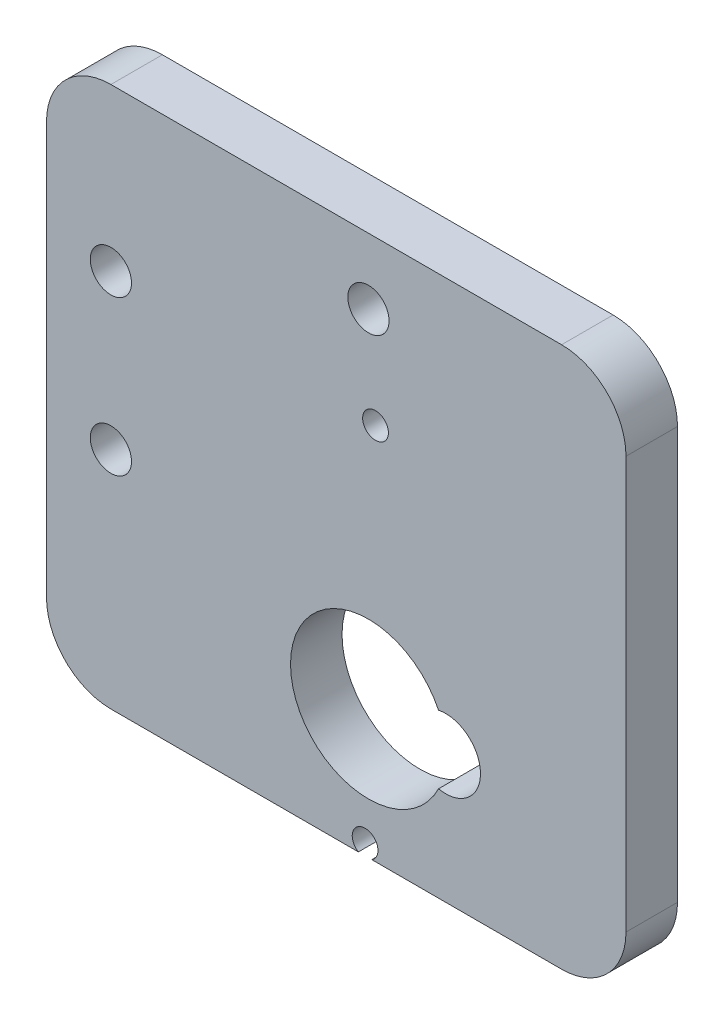
ISO-10303-21;
HEADER;
FILE_DESCRIPTION(('STEP AP214'),'2;1');
FILE_NAME('part.step','',(''),(''),'','','');
FILE_SCHEMA(('AUTOMOTIVE_DESIGN { 1 0 10303 214 1 1 1 1 }'));
ENDSEC;
DATA;
#1=APPLICATION_CONTEXT('core data for automotive mechanical design processes');
#2=APPLICATION_PROTOCOL_DEFINITION('international standard','automotive_design',2000,#1);
#3=PRODUCT_CONTEXT('',#1,'mechanical');
#4=PRODUCT('Part','Part','',(#3));
#5=PRODUCT_RELATED_PRODUCT_CATEGORY('part','',(#4));
#6=PRODUCT_DEFINITION_FORMATION('','',#4);
#7=PRODUCT_DEFINITION_CONTEXT('part definition',#1,'design');
#8=PRODUCT_DEFINITION('design','',#6,#7);
#9=PRODUCT_DEFINITION_SHAPE('','',#8);
#10=(LENGTH_UNIT() NAMED_UNIT(*) SI_UNIT(.MILLI.,.METRE.));
#11=(NAMED_UNIT(*) PLANE_ANGLE_UNIT() SI_UNIT($,.RADIAN.));
#12=(NAMED_UNIT(*) SI_UNIT($,.STERADIAN.) SOLID_ANGLE_UNIT());
#13=UNCERTAINTY_MEASURE_WITH_UNIT(LENGTH_MEASURE(1.E-05),#10,'distance_accuracy_value','');
#14=(GEOMETRIC_REPRESENTATION_CONTEXT(3) GLOBAL_UNCERTAINTY_ASSIGNED_CONTEXT((#13)) GLOBAL_UNIT_ASSIGNED_CONTEXT((#10,
#11,#12)) REPRESENTATION_CONTEXT('',''));
#15=CARTESIAN_POINT('',(0.,0.,0.));
#16=DIRECTION('',(0.,0.,1.));
#17=DIRECTION('',(1.,0.,0.));
#18=AXIS2_PLACEMENT_3D('',#15,#16,#17);
#19=CARTESIAN_POINT('',(-0.260165336111977,-9.14630056350009,4.));
#20=DIRECTION('',(0.,0.,-1.));
#21=DIRECTION('',(-1.,0.,0.));
#22=AXIS2_PLACEMENT_3D('',#19,#20,#21);
#23=CYLINDRICAL_SURFACE('',#22,1.);
#24=CARTESIAN_POINT('',(-0.260165336111977,-9.14630056350009,0.));
#25=DIRECTION('',(0.,0.,1.));
#26=DIRECTION('',(1.,0.,0.));
#27=AXIS2_PLACEMENT_3D('',#24,#25,#26);
#28=CIRCLE('',#27,1.);
#29=CARTESIAN_POINT('',(0.260600707442846,-10.,0.));
#30=VERTEX_POINT('',#29);
#31=CARTESIAN_POINT('',(-0.780931379666799,-10.,0.));
#32=VERTEX_POINT('',#31);
#33=EDGE_CURVE('E177',#30,#32,#28,.T.);
#34=ORIENTED_EDGE('',*,*,#33,.F.);
#35=DIRECTION('',(0.,0.,-1.));
#36=VECTOR('',#35,1.);
#37=CARTESIAN_POINT('',(0.260600707442846,-10.,4.));
#38=LINE('',#37,#36);
#39=CARTESIAN_POINT('',(0.260600707442846,-10.,4.));
#40=VERTEX_POINT('',#39);
#41=EDGE_CURVE('E198',#40,#30,#38,.T.);
#42=ORIENTED_EDGE('',*,*,#41,.F.);
#43=CARTESIAN_POINT('',(-0.260165336111977,-9.14630056350009,4.));
#44=DIRECTION('',(0.,0.,1.));
#45=DIRECTION('',(1.,0.,0.));
#46=AXIS2_PLACEMENT_3D('',#43,#44,#45);
#47=CIRCLE('',#46,1.);
#48=CARTESIAN_POINT('',(-0.780931379666799,-10.,4.));
#49=VERTEX_POINT('',#48);
#50=EDGE_CURVE('E144',#40,#49,#47,.T.);
#51=ORIENTED_EDGE('',*,*,#50,.T.);
#52=DIRECTION('',(0.,0.,-1.));
#53=VECTOR('',#52,1.);
#54=CARTESIAN_POINT('',(-0.780931379666799,-10.,4.));
#55=LINE('',#54,#53);
#56=EDGE_CURVE('E135',#49,#32,#55,.T.);
#57=ORIENTED_EDGE('',*,*,#56,.T.);
#58=EDGE_LOOP('',(#34,#42,#51,#57));
#59=FACE_BOUND('',#58,.T.);
#60=ADVANCED_FACE('F35',(#59),#23,.F.);
#61=CARTESIAN_POINT('',(0.,-10.,4.));
#62=DIRECTION('',(0.,1.,0.));
#63=DIRECTION('',(-1.,0.,0.));
#64=AXIS2_PLACEMENT_3D('',#61,#62,#63);
#65=PLANE('',#64);
#66=DIRECTION('',(1.,0.,0.));
#67=VECTOR('',#66,1.);
#68=CARTESIAN_POINT('',(0.,-10.,0.));
#69=LINE('',#68,#67);
#70=CARTESIAN_POINT('',(15.,-10.,0.));
#71=VERTEX_POINT('',#70);
#72=EDGE_CURVE('E180',#30,#71,#69,.T.);
#73=ORIENTED_EDGE('',*,*,#72,.T.);
#74=DIRECTION('',(0.,0.,-1.));
#75=VECTOR('',#74,1.);
#76=CARTESIAN_POINT('',(15.,-10.,4.));
#77=LINE('',#76,#75);
#78=CARTESIAN_POINT('',(15.,-10.,4.));
#79=VERTEX_POINT('',#78);
#80=EDGE_CURVE('E226',#71,#79,#77,.F.);
#81=ORIENTED_EDGE('',*,*,#80,.T.);
#82=DIRECTION('',(1.,0.,0.));
#83=VECTOR('',#82,1.);
#84=CARTESIAN_POINT('',(0.,-10.,4.));
#85=LINE('',#84,#83);
#86=EDGE_CURVE('E147',#40,#79,#85,.T.);
#87=ORIENTED_EDGE('',*,*,#86,.F.);
#88=ORIENTED_EDGE('',*,*,#41,.T.);
#89=EDGE_LOOP('',(#73,#81,#87,#88));
#90=FACE_BOUND('',#89,.T.);
#91=ADVANCED_FACE('F256',(#90),#65,.F.);
#92=CARTESIAN_POINT('',(20.,0.,4.));
#93=DIRECTION('',(1.,0.,0.));
#94=DIRECTION('',(0.,1.,0.));
#95=AXIS2_PLACEMENT_3D('',#92,#93,#94);
#96=PLANE('',#95);
#97=DIRECTION('',(0.,-1.,0.));
#98=VECTOR('',#97,1.);
#99=CARTESIAN_POINT('',(20.,0.,0.));
#100=LINE('',#99,#98);
#101=CARTESIAN_POINT('',(20.,27.,0.));
#102=VERTEX_POINT('',#101);
#103=CARTESIAN_POINT('',(20.,-5.,0.));
#104=VERTEX_POINT('',#103);
#105=EDGE_CURVE('E183',#102,#104,#100,.T.);
#106=ORIENTED_EDGE('',*,*,#105,.F.);
#107=DIRECTION('',(0.,0.,-1.));
#108=VECTOR('',#107,1.);
#109=CARTESIAN_POINT('',(20.,27.,4.));
#110=LINE('',#109,#108);
#111=CARTESIAN_POINT('',(20.,27.,4.));
#112=VERTEX_POINT('',#111);
#113=EDGE_CURVE('E217',#102,#112,#110,.F.);
#114=ORIENTED_EDGE('',*,*,#113,.T.);
#115=DIRECTION('',(0.,-1.,0.));
#116=VECTOR('',#115,1.);
#117=CARTESIAN_POINT('',(20.,0.,4.));
#118=LINE('',#117,#116);
#119=CARTESIAN_POINT('',(20.,-5.,4.));
#120=VERTEX_POINT('',#119);
#121=EDGE_CURVE('E153',#112,#120,#118,.T.);
#122=ORIENTED_EDGE('',*,*,#121,.T.);
#123=DIRECTION('',(0.,0.,-1.));
#124=VECTOR('',#123,1.);
#125=CARTESIAN_POINT('',(20.,-5.,0.));
#126=LINE('',#125,#124);
#127=EDGE_CURVE('E214',#120,#104,#126,.T.);
#128=ORIENTED_EDGE('',*,*,#127,.T.);
#129=EDGE_LOOP('',(#106,#114,#122,#128));
#130=FACE_BOUND('',#129,.T.);
#131=ADVANCED_FACE('F264',(#130),#96,.T.);
#132=CARTESIAN_POINT('',(0.,32.,4.));
#133=DIRECTION('',(0.,1.,0.));
#134=DIRECTION('',(0.,0.,1.));
#135=AXIS2_PLACEMENT_3D('',#132,#133,#134);
#136=PLANE('',#135);
#137=DIRECTION('',(1.,0.,0.));
#138=VECTOR('',#137,1.);
#139=CARTESIAN_POINT('',(0.,32.,4.));
#140=LINE('',#139,#138);
#141=CARTESIAN_POINT('',(-20.,32.,4.));
#142=VERTEX_POINT('',#141);
#143=CARTESIAN_POINT('',(15.,32.,4.));
#144=VERTEX_POINT('',#143);
#145=EDGE_CURVE('E157',#142,#144,#140,.T.);
#146=ORIENTED_EDGE('',*,*,#145,.T.);
#147=DIRECTION('',(0.,0.,-1.));
#148=VECTOR('',#147,1.);
#149=CARTESIAN_POINT('',(15.,32.,4.));
#150=LINE('',#149,#148);
#151=CARTESIAN_POINT('',(15.,32.,0.));
#152=VERTEX_POINT('',#151);
#153=EDGE_CURVE('E203',#144,#152,#150,.T.);
#154=ORIENTED_EDGE('',*,*,#153,.T.);
#155=DIRECTION('',(1.,0.,0.));
#156=VECTOR('',#155,1.);
#157=CARTESIAN_POINT('',(0.,32.,0.));
#158=LINE('',#157,#156);
#159=CARTESIAN_POINT('',(-20.,32.,0.));
#160=VERTEX_POINT('',#159);
#161=EDGE_CURVE('E187',#160,#152,#158,.T.);
#162=ORIENTED_EDGE('',*,*,#161,.F.);
#163=DIRECTION('',(0.,0.,-1.));
#164=VECTOR('',#163,1.);
#165=CARTESIAN_POINT('',(-20.,32.,4.));
#166=LINE('',#165,#164);
#167=EDGE_CURVE('E200',#160,#142,#166,.F.);
#168=ORIENTED_EDGE('',*,*,#167,.T.);
#169=EDGE_LOOP('',(#146,#154,#162,#168));
#170=FACE_BOUND('',#169,.T.);
#171=ADVANCED_FACE('F271',(#170),#136,.T.);
#172=CARTESIAN_POINT('',(-25.,0.,4.));
#173=DIRECTION('',(1.,0.,0.));
#174=DIRECTION('',(0.,0.,-1.));
#175=AXIS2_PLACEMENT_3D('',#172,#173,#174);
#176=PLANE('',#175);
#177=DIRECTION('',(0.,-1.,0.));
#178=VECTOR('',#177,1.);
#179=CARTESIAN_POINT('',(-25.,0.,0.));
#180=LINE('',#179,#178);
#181=CARTESIAN_POINT('',(-25.,27.,0.));
#182=VERTEX_POINT('',#181);
#183=CARTESIAN_POINT('',(-25.,-5.,0.));
#184=VERTEX_POINT('',#183);
#185=EDGE_CURVE('E190',#182,#184,#180,.T.);
#186=ORIENTED_EDGE('',*,*,#185,.T.);
#187=DIRECTION('',(0.,0.,-1.));
#188=VECTOR('',#187,1.);
#189=CARTESIAN_POINT('',(-25.,-5.,4.));
#190=LINE('',#189,#188);
#191=CARTESIAN_POINT('',(-25.,-5.,4.));
#192=VERTEX_POINT('',#191);
#193=EDGE_CURVE('E11',#184,#192,#190,.F.);
#194=ORIENTED_EDGE('',*,*,#193,.T.);
#195=DIRECTION('',(0.,-1.,0.));
#196=VECTOR('',#195,1.);
#197=CARTESIAN_POINT('',(-25.,0.,4.));
#198=LINE('',#197,#196);
#199=CARTESIAN_POINT('',(-25.,27.,4.));
#200=VERTEX_POINT('',#199);
#201=EDGE_CURVE('E160',#200,#192,#198,.T.);
#202=ORIENTED_EDGE('',*,*,#201,.F.);
#203=DIRECTION('',(0.,0.,-1.));
#204=VECTOR('',#203,1.);
#205=CARTESIAN_POINT('',(-25.,27.,0.));
#206=LINE('',#205,#204);
#207=EDGE_CURVE('E43',#200,#182,#206,.T.);
#208=ORIENTED_EDGE('',*,*,#207,.T.);
#209=EDGE_LOOP('',(#186,#194,#202,#208));
#210=FACE_BOUND('',#209,.T.);
#211=ADVANCED_FACE('F233',(#210),#176,.F.);
#212=CARTESIAN_POINT('',(6.,0.,4.));
#213=DIRECTION('',(0.,0.,-1.));
#214=DIRECTION('',(-1.,0.,0.));
#215=AXIS2_PLACEMENT_3D('',#212,#213,#214);
#216=CYLINDRICAL_SURFACE('',#215,2.7);
#217=CARTESIAN_POINT('',(6.,0.,0.));
#218=DIRECTION('',(0.,0.,1.));
#219=DIRECTION('',(1.,0.,0.));
#220=AXIS2_PLACEMENT_3D('',#217,#218,#219);
#221=CIRCLE('',#220,2.7);
#222=CARTESIAN_POINT('',(5.44270833333333,-2.64186032906055,0.));
#223=VERTEX_POINT('',#222);
#224=CARTESIAN_POINT('',(5.44270833333333,2.64186032906054,0.));
#225=VERTEX_POINT('',#224);
#226=EDGE_CURVE('E130',#223,#225,#221,.T.);
#227=ORIENTED_EDGE('',*,*,#226,.F.);
#228=DIRECTION('',(0.,0.,-1.));
#229=VECTOR('',#228,1.);
#230=CARTESIAN_POINT('',(5.44270833333333,-2.64186032906055,4.));
#231=LINE('',#230,#229);
#232=CARTESIAN_POINT('',(5.44270833333333,-2.64186032906055,4.));
#233=VERTEX_POINT('',#232);
#234=EDGE_CURVE('E124',#233,#223,#231,.T.);
#235=ORIENTED_EDGE('',*,*,#234,.F.);
#236=CARTESIAN_POINT('',(6.,0.,4.));
#237=DIRECTION('',(0.,0.,1.));
#238=DIRECTION('',(1.,0.,0.));
#239=AXIS2_PLACEMENT_3D('',#236,#237,#238);
#240=CIRCLE('',#239,2.7);
#241=CARTESIAN_POINT('',(5.44270833333333,2.64186032906054,4.));
#242=VERTEX_POINT('',#241);
#243=EDGE_CURVE('E127',#233,#242,#240,.T.);
#244=ORIENTED_EDGE('',*,*,#243,.T.);
#245=DIRECTION('',(0.,0.,-1.));
#246=VECTOR('',#245,1.);
#247=CARTESIAN_POINT('',(5.44270833333333,2.64186032906054,4.));
#248=LINE('',#247,#246);
#249=EDGE_CURVE('E136',#242,#225,#248,.T.);
#250=ORIENTED_EDGE('',*,*,#249,.T.);
#251=EDGE_LOOP('',(#227,#235,#244,#250));
#252=FACE_BOUND('',#251,.T.);
#253=ADVANCED_FACE('F126',(#252),#216,.F.);
#254=CARTESIAN_POINT('',(-20.,-10.,4.));
#255=VERTEX_POINT('',#254);
#256=EDGE_CURVE('E154',#255,#49,#85,.T.);
#257=ORIENTED_EDGE('',*,*,#256,.F.);
#258=DIRECTION('',(0.,0.,-1.));
#259=VECTOR('',#258,1.);
#260=CARTESIAN_POINT('',(-20.,-10.,4.));
#261=LINE('',#260,#259);
#262=CARTESIAN_POINT('',(-20.,-10.,0.));
#263=VERTEX_POINT('',#262);
#264=EDGE_CURVE('E228',#255,#263,#261,.T.);
#265=ORIENTED_EDGE('',*,*,#264,.T.);
#266=EDGE_CURVE('E184',#263,#32,#69,.T.);
#267=ORIENTED_EDGE('',*,*,#266,.T.);
#268=ORIENTED_EDGE('',*,*,#56,.F.);
#269=EDGE_LOOP('',(#257,#265,#267,#268));
#270=FACE_BOUND('',#269,.T.);
#271=ADVANCED_FACE('F245',(#270),#65,.F.);
#272=CARTESIAN_POINT('',(0.,0.,4.));
#273=DIRECTION('',(0.,0.,-1.));
#274=DIRECTION('',(-1.,0.,0.));
#275=AXIS2_PLACEMENT_3D('',#272,#273,#274);
#276=CYLINDRICAL_SURFACE('',#275,6.05);
#277=CARTESIAN_POINT('',(0.,0.,0.));
#278=DIRECTION('',(0.,0.,1.));
#279=DIRECTION('',(1.,0.,0.));
#280=AXIS2_PLACEMENT_3D('',#277,#278,#279);
#281=CIRCLE('',#280,6.05);
#282=EDGE_CURVE('E175',#225,#223,#281,.T.);
#283=ORIENTED_EDGE('',*,*,#282,.F.);
#284=ORIENTED_EDGE('',*,*,#249,.F.);
#285=CARTESIAN_POINT('',(0.,0.,4.));
#286=DIRECTION('',(0.,0.,1.));
#287=DIRECTION('',(1.,0.,0.));
#288=AXIS2_PLACEMENT_3D('',#285,#286,#287);
#289=CIRCLE('',#288,6.05);
#290=EDGE_CURVE('E140',#242,#233,#289,.T.);
#291=ORIENTED_EDGE('',*,*,#290,.T.);
#292=ORIENTED_EDGE('',*,*,#234,.T.);
#293=EDGE_LOOP('',(#283,#284,#291,#292));
#294=FACE_BOUND('',#293,.T.);
#295=ADVANCED_FACE('F143',(#294),#276,.F.);
#296=CARTESIAN_POINT('',(0.,26.9,4.));
#297=DIRECTION('',(0.,0.,-1.));
#298=DIRECTION('',(-1.,0.,0.));
#299=AXIS2_PLACEMENT_3D('',#296,#297,#298);
#300=CYLINDRICAL_SURFACE('',#299,1.6);
#301=CARTESIAN_POINT('',(0.,26.9,4.));
#302=DIRECTION('',(0.,0.,1.));
#303=DIRECTION('',(1.,0.,0.));
#304=AXIS2_PLACEMENT_3D('',#301,#302,#303);
#305=CIRCLE('',#304,1.6);
#306=CARTESIAN_POINT('',(1.6,26.9,4.));
#307=VERTEX_POINT('',#306);
#308=EDGE_CURVE('E141',#307,#307,#305,.T.);
#309=ORIENTED_EDGE('',*,*,#308,.T.);
#310=EDGE_LOOP('',(#309));
#311=FACE_BOUND('',#310,.T.);
#312=CARTESIAN_POINT('',(0.,26.9,0.));
#313=DIRECTION('',(0.,0.,1.));
#314=DIRECTION('',(1.,0.,0.));
#315=AXIS2_PLACEMENT_3D('',#312,#313,#314);
#316=CIRCLE('',#315,1.6);
#317=CARTESIAN_POINT('',(1.6,26.9,0.));
#318=VERTEX_POINT('',#317);
#319=EDGE_CURVE('E171',#318,#318,#316,.T.);
#320=ORIENTED_EDGE('',*,*,#319,.F.);
#321=EDGE_LOOP('',(#320));
#322=FACE_BOUND('',#321,.T.);
#323=ADVANCED_FACE('F288',(#311,#322),#300,.F.);
#324=CARTESIAN_POINT('',(-20.,19.45,4.));
#325=DIRECTION('',(0.,0.,-1.));
#326=DIRECTION('',(-1.,0.,0.));
#327=AXIS2_PLACEMENT_3D('',#324,#325,#326);
#328=CYLINDRICAL_SURFACE('',#327,1.6);
#329=CARTESIAN_POINT('',(-20.,19.45,4.));
#330=DIRECTION('',(0.,0.,1.));
#331=DIRECTION('',(1.,0.,0.));
#332=AXIS2_PLACEMENT_3D('',#329,#330,#331);
#333=CIRCLE('',#332,1.6);
#334=CARTESIAN_POINT('',(-18.4,19.45,4.));
#335=VERTEX_POINT('',#334);
#336=EDGE_CURVE('E439',#335,#335,#333,.T.);
#337=ORIENTED_EDGE('',*,*,#336,.T.);
#338=EDGE_LOOP('',(#337));
#339=FACE_BOUND('',#338,.T.);
#340=CARTESIAN_POINT('',(-20.,19.45,0.));
#341=DIRECTION('',(0.,0.,1.));
#342=DIRECTION('',(1.,0.,0.));
#343=AXIS2_PLACEMENT_3D('',#340,#341,#342);
#344=CIRCLE('',#343,1.6);
#345=CARTESIAN_POINT('',(-18.4,19.45,0.));
#346=VERTEX_POINT('',#345);
#347=EDGE_CURVE('E168',#346,#346,#344,.T.);
#348=ORIENTED_EDGE('',*,*,#347,.F.);
#349=EDGE_LOOP('',(#348));
#350=FACE_BOUND('',#349,.T.);
#351=ADVANCED_FACE('F293',(#339,#350),#328,.F.);
#352=CARTESIAN_POINT('',(-20.,7.45,4.));
#353=DIRECTION('',(0.,0.,-1.));
#354=DIRECTION('',(-1.,0.,0.));
#355=AXIS2_PLACEMENT_3D('',#352,#353,#354);
#356=CYLINDRICAL_SURFACE('',#355,1.6);
#357=CARTESIAN_POINT('',(-20.,7.45,4.));
#358=DIRECTION('',(0.,0.,1.));
#359=DIRECTION('',(1.,0.,0.));
#360=AXIS2_PLACEMENT_3D('',#357,#358,#359);
#361=CIRCLE('',#360,1.6);
#362=CARTESIAN_POINT('',(-18.4,7.45,4.));
#363=VERTEX_POINT('',#362);
#364=EDGE_CURVE('E195',#363,#363,#361,.T.);
#365=ORIENTED_EDGE('',*,*,#364,.T.);
#366=EDGE_LOOP('',(#365));
#367=FACE_BOUND('',#366,.T.);
#368=CARTESIAN_POINT('',(-20.,7.45,0.));
#369=DIRECTION('',(0.,0.,1.));
#370=DIRECTION('',(1.,0.,0.));
#371=AXIS2_PLACEMENT_3D('',#368,#369,#370);
#372=CIRCLE('',#371,1.6);
#373=CARTESIAN_POINT('',(-18.4,7.45,0.));
#374=VERTEX_POINT('',#373);
#375=EDGE_CURVE('E165',#374,#374,#372,.T.);
#376=ORIENTED_EDGE('',*,*,#375,.F.);
#377=EDGE_LOOP('',(#376));
#378=FACE_BOUND('',#377,.T.);
#379=ADVANCED_FACE('F297',(#367,#378),#356,.F.);
#380=CARTESIAN_POINT('',(0.5501857107943,19.3421766015008,4.));
#381=DIRECTION('',(0.,0.,-1.));
#382=DIRECTION('',(-1.,0.,0.));
#383=AXIS2_PLACEMENT_3D('',#380,#381,#382);
#384=CYLINDRICAL_SURFACE('',#383,0.999999999999997);
#385=CARTESIAN_POINT('',(0.5501857107943,19.3421766015008,4.));
#386=DIRECTION('',(0.,0.,1.));
#387=DIRECTION('',(1.,0.,0.));
#388=AXIS2_PLACEMENT_3D('',#385,#386,#387);
#389=CIRCLE('',#388,0.999999999999997);
#390=CARTESIAN_POINT('',(1.5501857107943,19.3421766015008,4.));
#391=VERTEX_POINT('',#390);
#392=EDGE_CURVE('E162',#391,#391,#389,.T.);
#393=ORIENTED_EDGE('',*,*,#392,.T.);
#394=EDGE_LOOP('',(#393));
#395=FACE_BOUND('',#394,.T.);
#396=CARTESIAN_POINT('',(0.5501857107943,19.3421766015008,0.));
#397=DIRECTION('',(0.,0.,1.));
#398=DIRECTION('',(1.,0.,0.));
#399=AXIS2_PLACEMENT_3D('',#396,#397,#398);
#400=CIRCLE('',#399,0.999999999999997);
#401=CARTESIAN_POINT('',(1.5501857107943,19.3421766015008,0.));
#402=VERTEX_POINT('',#401);
#403=EDGE_CURVE('E192',#402,#402,#400,.T.);
#404=ORIENTED_EDGE('',*,*,#403,.F.);
#405=EDGE_LOOP('',(#404));
#406=FACE_BOUND('',#405,.T.);
#407=ADVANCED_FACE('F301',(#395,#406),#384,.F.);
#408=CARTESIAN_POINT('',(0.,0.,4.));
#409=DIRECTION('',(0.,0.,1.));
#410=DIRECTION('',(1.,0.,0.));
#411=AXIS2_PLACEMENT_3D('',#408,#409,#410);
#412=PLANE('',#411);
#413=ORIENTED_EDGE('',*,*,#364,.F.);
#414=EDGE_LOOP('',(#413));
#415=FACE_BOUND('',#414,.T.);
#416=ORIENTED_EDGE('',*,*,#336,.F.);
#417=EDGE_LOOP('',(#416));
#418=FACE_BOUND('',#417,.T.);
#419=ORIENTED_EDGE('',*,*,#308,.F.);
#420=EDGE_LOOP('',(#419));
#421=FACE_BOUND('',#420,.T.);
#422=ORIENTED_EDGE('',*,*,#243,.F.);
#423=ORIENTED_EDGE('',*,*,#290,.F.);
#424=EDGE_LOOP('',(#422,#423));
#425=FACE_BOUND('',#424,.T.);
#426=ORIENTED_EDGE('',*,*,#121,.F.);
#427=CARTESIAN_POINT('',(15.,27.,4.));
#428=DIRECTION('',(0.,0.,1.));
#429=DIRECTION('',(1.,0.,0.));
#430=AXIS2_PLACEMENT_3D('',#427,#428,#429);
#431=CIRCLE('',#430,5.);
#432=EDGE_CURVE('E224',#112,#144,#431,.T.);
#433=ORIENTED_EDGE('',*,*,#432,.T.);
#434=ORIENTED_EDGE('',*,*,#145,.F.);
#435=CARTESIAN_POINT('',(-20.,27.,4.));
#436=DIRECTION('',(0.,0.,1.));
#437=DIRECTION('',(1.,0.,0.));
#438=AXIS2_PLACEMENT_3D('',#435,#436,#437);
#439=CIRCLE('',#438,5.);
#440=EDGE_CURVE('E219',#142,#200,#439,.T.);
#441=ORIENTED_EDGE('',*,*,#440,.T.);
#442=ORIENTED_EDGE('',*,*,#201,.T.);
#443=CARTESIAN_POINT('',(-20.,-5.,4.));
#444=DIRECTION('',(0.,0.,1.));
#445=DIRECTION('',(1.,0.,0.));
#446=AXIS2_PLACEMENT_3D('',#443,#444,#445);
#447=CIRCLE('',#446,5.);
#448=EDGE_CURVE('E50',#192,#255,#447,.T.);
#449=ORIENTED_EDGE('',*,*,#448,.T.);
#450=ORIENTED_EDGE('',*,*,#256,.T.);
#451=ORIENTED_EDGE('',*,*,#50,.F.);
#452=ORIENTED_EDGE('',*,*,#86,.T.);
#453=CARTESIAN_POINT('',(15.,-5.,4.));
#454=DIRECTION('',(0.,0.,1.));
#455=DIRECTION('',(1.,0.,0.));
#456=AXIS2_PLACEMENT_3D('',#453,#454,#455);
#457=CIRCLE('',#456,5.);
#458=EDGE_CURVE('E222',#79,#120,#457,.T.);
#459=ORIENTED_EDGE('',*,*,#458,.T.);
#460=EDGE_LOOP('',(#426,#433,#434,#441,#442,#449,#450,#451,#452,#459));
#461=FACE_BOUND('',#460,.T.);
#462=ORIENTED_EDGE('',*,*,#392,.F.);
#463=EDGE_LOOP('',(#462));
#464=FACE_BOUND('',#463,.T.);
#465=ADVANCED_FACE('F139',(#415,#418,#421,#425,#461,#464),#412,.T.);
#466=CARTESIAN_POINT('',(0.,0.,0.));
#467=DIRECTION('',(0.,0.,1.));
#468=DIRECTION('',(1.,0.,0.));
#469=AXIS2_PLACEMENT_3D('',#466,#467,#468);
#470=PLANE('',#469);
#471=ORIENTED_EDGE('',*,*,#375,.T.);
#472=EDGE_LOOP('',(#471));
#473=FACE_BOUND('',#472,.T.);
#474=ORIENTED_EDGE('',*,*,#347,.T.);
#475=EDGE_LOOP('',(#474));
#476=FACE_BOUND('',#475,.T.);
#477=ORIENTED_EDGE('',*,*,#319,.T.);
#478=EDGE_LOOP('',(#477));
#479=FACE_BOUND('',#478,.T.);
#480=ORIENTED_EDGE('',*,*,#226,.T.);
#481=ORIENTED_EDGE('',*,*,#282,.T.);
#482=EDGE_LOOP('',(#480,#481));
#483=FACE_BOUND('',#482,.T.);
#484=ORIENTED_EDGE('',*,*,#161,.T.);
#485=CARTESIAN_POINT('',(15.,27.,0.));
#486=DIRECTION('',(0.,0.,1.));
#487=DIRECTION('',(1.,0.,0.));
#488=AXIS2_PLACEMENT_3D('',#485,#486,#487);
#489=CIRCLE('',#488,5.);
#490=EDGE_CURVE('E212',#152,#102,#489,.F.);
#491=ORIENTED_EDGE('',*,*,#490,.T.);
#492=ORIENTED_EDGE('',*,*,#105,.T.);
#493=CARTESIAN_POINT('',(15.,-5.,0.));
#494=DIRECTION('',(0.,0.,1.));
#495=DIRECTION('',(1.,0.,0.));
#496=AXIS2_PLACEMENT_3D('',#493,#494,#495);
#497=CIRCLE('',#496,5.);
#498=EDGE_CURVE('E210',#104,#71,#497,.F.);
#499=ORIENTED_EDGE('',*,*,#498,.T.);
#500=ORIENTED_EDGE('',*,*,#72,.F.);
#501=ORIENTED_EDGE('',*,*,#33,.T.);
#502=ORIENTED_EDGE('',*,*,#266,.F.);
#503=CARTESIAN_POINT('',(-20.,-5.,0.));
#504=DIRECTION('',(0.,0.,1.));
#505=DIRECTION('',(1.,0.,0.));
#506=AXIS2_PLACEMENT_3D('',#503,#504,#505);
#507=CIRCLE('',#506,5.);
#508=EDGE_CURVE('E208',#263,#184,#507,.F.);
#509=ORIENTED_EDGE('',*,*,#508,.T.);
#510=ORIENTED_EDGE('',*,*,#185,.F.);
#511=CARTESIAN_POINT('',(-20.,27.,0.));
#512=DIRECTION('',(0.,0.,1.));
#513=DIRECTION('',(1.,0.,0.));
#514=AXIS2_PLACEMENT_3D('',#511,#512,#513);
#515=CIRCLE('',#514,5.);
#516=EDGE_CURVE('E206',#182,#160,#515,.F.);
#517=ORIENTED_EDGE('',*,*,#516,.T.);
#518=EDGE_LOOP('',(#484,#491,#492,#499,#500,#501,#502,#509,#510,#517));
#519=FACE_BOUND('',#518,.T.);
#520=ORIENTED_EDGE('',*,*,#403,.T.);
#521=EDGE_LOOP('',(#520));
#522=FACE_BOUND('',#521,.T.);
#523=ADVANCED_FACE('F237',(#473,#476,#479,#483,#519,#522),#470,.F.);
#524=CARTESIAN_POINT('',(15.,27.,4.));
#525=DIRECTION('',(0.,0.,-1.));
#526=DIRECTION('',(-1.,0.,0.));
#527=AXIS2_PLACEMENT_3D('',#524,#525,#526);
#528=CYLINDRICAL_SURFACE('',#527,5.);
#529=ORIENTED_EDGE('',*,*,#432,.F.);
#530=ORIENTED_EDGE('',*,*,#113,.F.);
#531=ORIENTED_EDGE('',*,*,#490,.F.);
#532=ORIENTED_EDGE('',*,*,#153,.F.);
#533=EDGE_LOOP('',(#529,#530,#531,#532));
#534=FACE_BOUND('',#533,.T.);
#535=ADVANCED_FACE('F267',(#534),#528,.T.);
#536=CARTESIAN_POINT('',(15.,-5.,4.));
#537=DIRECTION('',(0.,0.,1.));
#538=DIRECTION('',(1.,0.,0.));
#539=AXIS2_PLACEMENT_3D('',#536,#537,#538);
#540=CYLINDRICAL_SURFACE('',#539,5.);
#541=ORIENTED_EDGE('',*,*,#458,.F.);
#542=ORIENTED_EDGE('',*,*,#80,.F.);
#543=ORIENTED_EDGE('',*,*,#498,.F.);
#544=ORIENTED_EDGE('',*,*,#127,.F.);
#545=EDGE_LOOP('',(#541,#542,#543,#544));
#546=FACE_BOUND('',#545,.T.);
#547=ADVANCED_FACE('F259',(#546),#540,.T.);
#548=CARTESIAN_POINT('',(-20.,-5.,4.));
#549=DIRECTION('',(0.,0.,-1.));
#550=DIRECTION('',(-1.,0.,0.));
#551=AXIS2_PLACEMENT_3D('',#548,#549,#550);
#552=CYLINDRICAL_SURFACE('',#551,5.);
#553=ORIENTED_EDGE('',*,*,#448,.F.);
#554=ORIENTED_EDGE('',*,*,#193,.F.);
#555=ORIENTED_EDGE('',*,*,#508,.F.);
#556=ORIENTED_EDGE('',*,*,#264,.F.);
#557=EDGE_LOOP('',(#553,#554,#555,#556));
#558=FACE_BOUND('',#557,.T.);
#559=ADVANCED_FACE('F243',(#558),#552,.T.);
#560=CARTESIAN_POINT('',(-20.,27.,4.));
#561=DIRECTION('',(0.,0.,1.));
#562=DIRECTION('',(1.,0.,0.));
#563=AXIS2_PLACEMENT_3D('',#560,#561,#562);
#564=CYLINDRICAL_SURFACE('',#563,5.);
#565=ORIENTED_EDGE('',*,*,#440,.F.);
#566=ORIENTED_EDGE('',*,*,#167,.F.);
#567=ORIENTED_EDGE('',*,*,#516,.F.);
#568=ORIENTED_EDGE('',*,*,#207,.F.);
#569=EDGE_LOOP('',(#565,#566,#567,#568));
#570=FACE_BOUND('',#569,.T.);
#571=ADVANCED_FACE('F37',(#570),#564,.T.);
#572=CLOSED_SHELL('',(#60,#91,#131,#171,#211,#253,#271,#295,#323,#351,#379,#407,#465,#523,#535,
#547,#559,#571));
#573=MANIFOLD_SOLID_BREP('B2',#572);
#574=ADVANCED_BREP_SHAPE_REPRESENTATION('',(#18,#573),#14);
#575=SHAPE_DEFINITION_REPRESENTATION(#9,#574);
ENDSEC;
END-ISO-10303-21;
